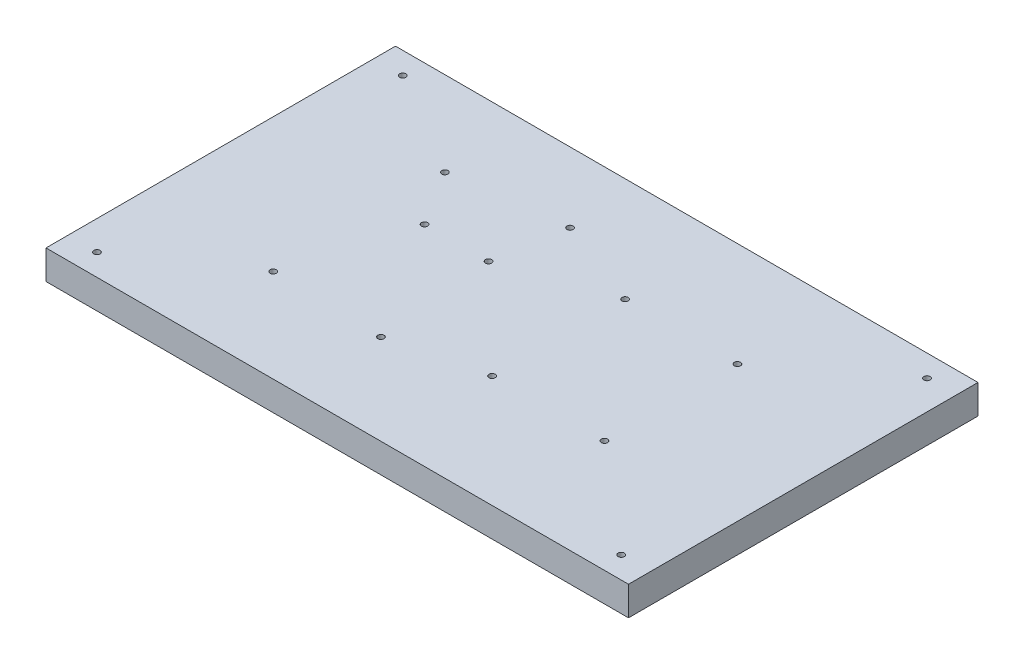
ISO-10303-21;
HEADER;
FILE_DESCRIPTION(('STEP AP214'),'2;1');
FILE_NAME('part.step','',(''),(''),'','','');
FILE_SCHEMA(('AUTOMOTIVE_DESIGN { 1 0 10303 214 1 1 1 1 }'));
ENDSEC;
DATA;
#1=APPLICATION_CONTEXT('core data for automotive mechanical design processes');
#2=APPLICATION_PROTOCOL_DEFINITION('international standard','automotive_design',2000,#1);
#3=PRODUCT_CONTEXT('',#1,'mechanical');
#4=PRODUCT('Part','Part','',(#3));
#5=PRODUCT_RELATED_PRODUCT_CATEGORY('part','',(#4));
#6=PRODUCT_DEFINITION_FORMATION('','',#4);
#7=PRODUCT_DEFINITION_CONTEXT('part definition',#1,'design');
#8=PRODUCT_DEFINITION('design','',#6,#7);
#9=PRODUCT_DEFINITION_SHAPE('','',#8);
#10=(LENGTH_UNIT() NAMED_UNIT(*) SI_UNIT(.MILLI.,.METRE.));
#11=(NAMED_UNIT(*) PLANE_ANGLE_UNIT() SI_UNIT($,.RADIAN.));
#12=(NAMED_UNIT(*) SI_UNIT($,.STERADIAN.) SOLID_ANGLE_UNIT());
#13=UNCERTAINTY_MEASURE_WITH_UNIT(LENGTH_MEASURE(1.E-05),#10,'distance_accuracy_value','');
#14=(GEOMETRIC_REPRESENTATION_CONTEXT(3) GLOBAL_UNCERTAINTY_ASSIGNED_CONTEXT((#13)) GLOBAL_UNIT_ASSIGNED_CONTEXT((#10,
#11,#12)) REPRESENTATION_CONTEXT('',''));
#15=CARTESIAN_POINT('',(0.,0.,0.));
#16=DIRECTION('',(0.,0.,1.));
#17=DIRECTION('',(1.,0.,0.));
#18=AXIS2_PLACEMENT_3D('',#15,#16,#17);
#19=CARTESIAN_POINT('',(0.,12.7,0.));
#20=DIRECTION('',(0.,0.,-1.));
#21=DIRECTION('',(-1.,0.,0.));
#22=AXIS2_PLACEMENT_3D('',#19,#20,#21);
#23=PLANE('',#22);
#24=DIRECTION('',(1.,0.,0.));
#25=VECTOR('',#24,1.);
#26=CARTESIAN_POINT('',(0.,0.,0.));
#27=LINE('',#26,#25);
#28=CARTESIAN_POINT('',(0.,0.,0.));
#29=VERTEX_POINT('',#28);
#30=CARTESIAN_POINT('',(254.,0.,0.));
#31=VERTEX_POINT('',#30);
#32=EDGE_CURVE('E96',#29,#31,#27,.T.);
#33=ORIENTED_EDGE('',*,*,#32,.T.);
#34=DIRECTION('',(0.,-1.,0.));
#35=VECTOR('',#34,1.);
#36=CARTESIAN_POINT('',(254.,12.7,0.));
#37=LINE('',#36,#35);
#38=CARTESIAN_POINT('',(254.,12.7,0.));
#39=VERTEX_POINT('',#38);
#40=EDGE_CURVE('E11',#39,#31,#37,.T.);
#41=ORIENTED_EDGE('',*,*,#40,.F.);
#42=DIRECTION('',(1.,0.,0.));
#43=VECTOR('',#42,1.);
#44=CARTESIAN_POINT('',(0.,12.7,0.));
#45=LINE('',#44,#43);
#46=CARTESIAN_POINT('',(0.,12.7,0.));
#47=VERTEX_POINT('',#46);
#48=EDGE_CURVE('E84',#47,#39,#45,.T.);
#49=ORIENTED_EDGE('',*,*,#48,.F.);
#50=DIRECTION('',(0.,-1.,0.));
#51=VECTOR('',#50,1.);
#52=CARTESIAN_POINT('',(0.,12.7,0.));
#53=LINE('',#52,#51);
#54=EDGE_CURVE('E92',#47,#29,#53,.T.);
#55=ORIENTED_EDGE('',*,*,#54,.T.);
#56=EDGE_LOOP('',(#33,#41,#49,#55));
#57=FACE_BOUND('',#56,.T.);
#58=ADVANCED_FACE('F33',(#57),#23,.F.);
#59=CARTESIAN_POINT('',(254.,12.7,-152.4));
#60=DIRECTION('',(-1.,0.,0.));
#61=DIRECTION('',(0.,0.,1.));
#62=AXIS2_PLACEMENT_3D('',#59,#60,#61);
#63=PLANE('',#62);
#64=DIRECTION('',(0.,0.,-1.));
#65=VECTOR('',#64,1.);
#66=CARTESIAN_POINT('',(254.,0.,-152.4));
#67=LINE('',#66,#65);
#68=CARTESIAN_POINT('',(254.,0.,-152.4));
#69=VERTEX_POINT('',#68);
#70=EDGE_CURVE('E88',#31,#69,#67,.T.);
#71=ORIENTED_EDGE('',*,*,#70,.T.);
#72=DIRECTION('',(0.,-1.,0.));
#73=VECTOR('',#72,1.);
#74=CARTESIAN_POINT('',(254.,12.7,-152.4));
#75=LINE('',#74,#73);
#76=CARTESIAN_POINT('',(254.,12.7,-152.4));
#77=VERTEX_POINT('',#76);
#78=EDGE_CURVE('E41',#77,#69,#75,.T.);
#79=ORIENTED_EDGE('',*,*,#78,.F.);
#80=DIRECTION('',(0.,0.,-1.));
#81=VECTOR('',#80,1.);
#82=CARTESIAN_POINT('',(254.,12.7,-152.4));
#83=LINE('',#82,#81);
#84=EDGE_CURVE('E79',#39,#77,#83,.T.);
#85=ORIENTED_EDGE('',*,*,#84,.F.);
#86=ORIENTED_EDGE('',*,*,#40,.T.);
#87=EDGE_LOOP('',(#71,#79,#85,#86));
#88=FACE_BOUND('',#87,.T.);
#89=ADVANCED_FACE('F87',(#88),#63,.F.);
#90=CARTESIAN_POINT('',(0.,12.7,-152.4));
#91=DIRECTION('',(0.,0.,1.));
#92=DIRECTION('',(1.,0.,0.));
#93=AXIS2_PLACEMENT_3D('',#90,#91,#92);
#94=PLANE('',#93);
#95=DIRECTION('',(-1.,0.,0.));
#96=VECTOR('',#95,1.);
#97=CARTESIAN_POINT('',(0.,0.,-152.4));
#98=LINE('',#97,#96);
#99=CARTESIAN_POINT('',(0.,0.,-152.4));
#100=VERTEX_POINT('',#99);
#101=EDGE_CURVE('E66',#69,#100,#98,.T.);
#102=ORIENTED_EDGE('',*,*,#101,.T.);
#103=DIRECTION('',(0.,-1.,0.));
#104=VECTOR('',#103,1.);
#105=CARTESIAN_POINT('',(0.,12.7,-152.4));
#106=LINE('',#105,#104);
#107=CARTESIAN_POINT('',(0.,12.7,-152.4));
#108=VERTEX_POINT('',#107);
#109=EDGE_CURVE('E89',#108,#100,#106,.T.);
#110=ORIENTED_EDGE('',*,*,#109,.F.);
#111=DIRECTION('',(-1.,0.,0.));
#112=VECTOR('',#111,1.);
#113=CARTESIAN_POINT('',(0.,12.7,-152.4));
#114=LINE('',#113,#112);
#115=EDGE_CURVE('E82',#77,#108,#114,.T.);
#116=ORIENTED_EDGE('',*,*,#115,.F.);
#117=ORIENTED_EDGE('',*,*,#78,.T.);
#118=EDGE_LOOP('',(#102,#110,#116,#117));
#119=FACE_BOUND('',#118,.T.);
#120=ADVANCED_FACE('F90',(#119),#94,.F.);
#121=CARTESIAN_POINT('',(0.,12.7,0.));
#122=DIRECTION('',(1.,0.,0.));
#123=DIRECTION('',(0.,0.,-1.));
#124=AXIS2_PLACEMENT_3D('',#121,#122,#123);
#125=PLANE('',#124);
#126=DIRECTION('',(0.,0.,1.));
#127=VECTOR('',#126,1.);
#128=CARTESIAN_POINT('',(0.,0.,0.));
#129=LINE('',#128,#127);
#130=EDGE_CURVE('E72',#100,#29,#129,.T.);
#131=ORIENTED_EDGE('',*,*,#130,.T.);
#132=ORIENTED_EDGE('',*,*,#54,.F.);
#133=DIRECTION('',(0.,0.,1.));
#134=VECTOR('',#133,1.);
#135=CARTESIAN_POINT('',(0.,12.7,0.));
#136=LINE('',#135,#134);
#137=EDGE_CURVE('E49',#108,#47,#136,.T.);
#138=ORIENTED_EDGE('',*,*,#137,.F.);
#139=ORIENTED_EDGE('',*,*,#109,.T.);
#140=EDGE_LOOP('',(#131,#132,#138,#139));
#141=FACE_BOUND('',#140,.T.);
#142=ADVANCED_FACE('F104',(#141),#125,.F.);
#143=CARTESIAN_POINT('',(0.,12.7,0.));
#144=DIRECTION('',(0.,-1.,0.));
#145=DIRECTION('',(0.,0.,-1.));
#146=AXIS2_PLACEMENT_3D('',#143,#144,#145);
#147=PLANE('',#146);
#148=CARTESIAN_POINT('',(12.7,12.7,-9.52500000000001));
#149=DIRECTION('',(0.,1.,0.));
#150=DIRECTION('',(0.,0.,1.));
#151=AXIS2_PLACEMENT_3D('',#148,#149,#150);
#152=CIRCLE('',#151,1.34999999999999);
#153=CARTESIAN_POINT('',(12.7,12.7,-8.17500000000001));
#154=VERTEX_POINT('',#153);
#155=EDGE_CURVE('E190',#154,#154,#152,.T.);
#156=ORIENTED_EDGE('',*,*,#155,.F.);
#157=EDGE_LOOP('',(#156));
#158=FACE_BOUND('',#157,.T.);
#159=CARTESIAN_POINT('',(241.3,12.7,-9.52500000000001));
#160=DIRECTION('',(0.,1.,0.));
#161=DIRECTION('',(0.,0.,1.));
#162=AXIS2_PLACEMENT_3D('',#159,#160,#161);
#163=CIRCLE('',#162,1.34999999999999);
#164=CARTESIAN_POINT('',(241.3,12.7,-8.17500000000001));
#165=VERTEX_POINT('',#164);
#166=EDGE_CURVE('E184',#165,#165,#163,.T.);
#167=ORIENTED_EDGE('',*,*,#166,.F.);
#168=EDGE_LOOP('',(#167));
#169=FACE_BOUND('',#168,.T.);
#170=CARTESIAN_POINT('',(241.3,12.7,-142.875));
#171=DIRECTION('',(0.,1.,0.));
#172=DIRECTION('',(0.,0.,1.));
#173=AXIS2_PLACEMENT_3D('',#170,#171,#172);
#174=CIRCLE('',#173,1.34999999999999);
#175=CARTESIAN_POINT('',(241.3,12.7,-141.525));
#176=VERTEX_POINT('',#175);
#177=EDGE_CURVE('E178',#176,#176,#174,.T.);
#178=ORIENTED_EDGE('',*,*,#177,.F.);
#179=EDGE_LOOP('',(#178));
#180=FACE_BOUND('',#179,.T.);
#181=CARTESIAN_POINT('',(12.7,12.7,-142.875));
#182=DIRECTION('',(0.,1.,0.));
#183=DIRECTION('',(0.,0.,1.));
#184=AXIS2_PLACEMENT_3D('',#181,#182,#183);
#185=CIRCLE('',#184,1.34999999999999);
#186=CARTESIAN_POINT('',(12.7,12.7,-141.525));
#187=VERTEX_POINT('',#186);
#188=EDGE_CURVE('E172',#187,#187,#185,.T.);
#189=ORIENTED_EDGE('',*,*,#188,.F.);
#190=EDGE_LOOP('',(#189));
#191=FACE_BOUND('',#190,.T.);
#192=CARTESIAN_POINT('',(194.619999888,12.7,-48.9));
#193=DIRECTION('',(0.,1.,0.));
#194=DIRECTION('',(0.,0.,1.));
#195=AXIS2_PLACEMENT_3D('',#192,#193,#194);
#196=CIRCLE('',#195,1.34999999999999);
#197=CARTESIAN_POINT('',(194.619999888,12.7,-47.55));
#198=VERTEX_POINT('',#197);
#199=EDGE_CURVE('E166',#198,#198,#196,.T.);
#200=ORIENTED_EDGE('',*,*,#199,.F.);
#201=EDGE_LOOP('',(#200));
#202=FACE_BOUND('',#201,.T.);
#203=CARTESIAN_POINT('',(194.619999888,12.7,-106.9));
#204=DIRECTION('',(0.,1.,0.));
#205=DIRECTION('',(0.,0.,1.));
#206=AXIS2_PLACEMENT_3D('',#203,#204,#205);
#207=CIRCLE('',#206,1.34999999999999);
#208=CARTESIAN_POINT('',(194.619999888,12.7,-105.55));
#209=VERTEX_POINT('',#208);
#210=EDGE_CURVE('E160',#209,#209,#207,.T.);
#211=ORIENTED_EDGE('',*,*,#210,.F.);
#212=EDGE_LOOP('',(#211));
#213=FACE_BOUND('',#212,.T.);
#214=CARTESIAN_POINT('',(145.619999888,12.7,-106.9));
#215=DIRECTION('',(0.,1.,0.));
#216=DIRECTION('',(0.,0.,1.));
#217=AXIS2_PLACEMENT_3D('',#214,#215,#216);
#218=CIRCLE('',#217,1.34999999999999);
#219=CARTESIAN_POINT('',(145.619999888,12.7,-105.55));
#220=VERTEX_POINT('',#219);
#221=EDGE_CURVE('E154',#220,#220,#218,.T.);
#222=ORIENTED_EDGE('',*,*,#221,.F.);
#223=EDGE_LOOP('',(#222));
#224=FACE_BOUND('',#223,.T.);
#225=CARTESIAN_POINT('',(145.619999888,12.7,-48.9));
#226=DIRECTION('',(0.,1.,0.));
#227=DIRECTION('',(0.,0.,1.));
#228=AXIS2_PLACEMENT_3D('',#225,#226,#227);
#229=CIRCLE('',#228,1.34999999999999);
#230=CARTESIAN_POINT('',(145.619999888,12.7,-47.55));
#231=VERTEX_POINT('',#230);
#232=EDGE_CURVE('E148',#231,#231,#229,.T.);
#233=ORIENTED_EDGE('',*,*,#232,.F.);
#234=EDGE_LOOP('',(#233));
#235=FACE_BOUND('',#234,.T.);
#236=CARTESIAN_POINT('',(106.64,12.7,-121.87));
#237=DIRECTION('',(0.,1.,0.));
#238=DIRECTION('',(0.,0.,1.));
#239=AXIS2_PLACEMENT_3D('',#236,#237,#238);
#240=CIRCLE('',#239,1.35);
#241=CARTESIAN_POINT('',(106.64,12.7,-120.52));
#242=VERTEX_POINT('',#241);
#243=EDGE_CURVE('E142',#242,#242,#240,.T.);
#244=ORIENTED_EDGE('',*,*,#243,.F.);
#245=EDGE_LOOP('',(#244));
#246=FACE_BOUND('',#245,.T.);
#247=CARTESIAN_POINT('',(58.42,12.7,-115.51));
#248=DIRECTION('',(0.,1.,0.));
#249=DIRECTION('',(0.,0.,1.));
#250=AXIS2_PLACEMENT_3D('',#247,#248,#249);
#251=CIRCLE('',#250,1.35);
#252=CARTESIAN_POINT('',(58.42,12.7,-114.16));
#253=VERTEX_POINT('',#252);
#254=EDGE_CURVE('E136',#253,#253,#251,.T.);
#255=ORIENTED_EDGE('',*,*,#254,.F.);
#256=EDGE_LOOP('',(#255));
#257=FACE_BOUND('',#256,.T.);
#258=CARTESIAN_POINT('',(101.56,12.7,-91.42));
#259=DIRECTION('',(0.,1.,0.));
#260=DIRECTION('',(0.,0.,1.));
#261=AXIS2_PLACEMENT_3D('',#258,#259,#260);
#262=CIRCLE('',#261,1.35);
#263=CARTESIAN_POINT('',(101.56,12.7,-90.07));
#264=VERTEX_POINT('',#263);
#265=EDGE_CURVE('E130',#264,#264,#262,.T.);
#266=ORIENTED_EDGE('',*,*,#265,.F.);
#267=EDGE_LOOP('',(#266));
#268=FACE_BOUND('',#267,.T.);
#269=CARTESIAN_POINT('',(73.65,12.7,-91.42));
#270=DIRECTION('',(0.,1.,0.));
#271=DIRECTION('',(0.,0.,1.));
#272=AXIS2_PLACEMENT_3D('',#269,#270,#271);
#273=CIRCLE('',#272,1.35);
#274=CARTESIAN_POINT('',(73.65,12.7,-90.07));
#275=VERTEX_POINT('',#274);
#276=EDGE_CURVE('E124',#275,#275,#273,.T.);
#277=ORIENTED_EDGE('',*,*,#276,.F.);
#278=EDGE_LOOP('',(#277));
#279=FACE_BOUND('',#278,.T.);
#280=CARTESIAN_POINT('',(58.42,12.7,-40.63));
#281=DIRECTION('',(0.,1.,0.));
#282=DIRECTION('',(0.,0.,1.));
#283=AXIS2_PLACEMENT_3D('',#280,#281,#282);
#284=CIRCLE('',#283,1.35);
#285=CARTESIAN_POINT('',(58.42,12.7,-39.28));
#286=VERTEX_POINT('',#285);
#287=EDGE_CURVE('E118',#286,#286,#284,.T.);
#288=ORIENTED_EDGE('',*,*,#287,.F.);
#289=EDGE_LOOP('',(#288));
#290=FACE_BOUND('',#289,.T.);
#291=CARTESIAN_POINT('',(106.64,12.7,-39.4));
#292=DIRECTION('',(0.,1.,0.));
#293=DIRECTION('',(0.,0.,1.));
#294=AXIS2_PLACEMENT_3D('',#291,#292,#293);
#295=CIRCLE('',#294,1.35);
#296=CARTESIAN_POINT('',(106.64,12.7,-38.05));
#297=VERTEX_POINT('',#296);
#298=EDGE_CURVE('E112',#297,#297,#295,.T.);
#299=ORIENTED_EDGE('',*,*,#298,.F.);
#300=EDGE_LOOP('',(#299));
#301=FACE_BOUND('',#300,.T.);
#302=ORIENTED_EDGE('',*,*,#48,.T.);
#303=ORIENTED_EDGE('',*,*,#84,.T.);
#304=ORIENTED_EDGE('',*,*,#115,.T.);
#305=ORIENTED_EDGE('',*,*,#137,.T.);
#306=EDGE_LOOP('',(#302,#303,#304,#305));
#307=FACE_BOUND('',#306,.T.);
#308=ADVANCED_FACE('F80',(#158,#169,#180,#191,#202,#213,#224,#235,#246,#257,#268,#279,#290,#301,
#307),#147,.F.);
#309=CARTESIAN_POINT('',(0.,0.,0.));
#310=DIRECTION('',(0.,-1.,0.));
#311=DIRECTION('',(0.,0.,-1.));
#312=AXIS2_PLACEMENT_3D('',#309,#310,#311);
#313=PLANE('',#312);
#314=CARTESIAN_POINT('',(12.7,0.,-9.52500000000001));
#315=DIRECTION('',(0.,-1.,0.));
#316=DIRECTION('',(0.,0.,-1.));
#317=AXIS2_PLACEMENT_3D('',#314,#315,#316);
#318=CIRCLE('',#317,1.34999999999999);
#319=CARTESIAN_POINT('',(12.7,0.,-10.875));
#320=VERTEX_POINT('',#319);
#321=EDGE_CURVE('E187',#320,#320,#318,.T.);
#322=ORIENTED_EDGE('',*,*,#321,.F.);
#323=EDGE_LOOP('',(#322));
#324=FACE_BOUND('',#323,.T.);
#325=CARTESIAN_POINT('',(241.3,0.,-9.52500000000001));
#326=DIRECTION('',(0.,-1.,0.));
#327=DIRECTION('',(0.,0.,-1.));
#328=AXIS2_PLACEMENT_3D('',#325,#326,#327);
#329=CIRCLE('',#328,1.34999999999999);
#330=CARTESIAN_POINT('',(241.3,0.,-10.875));
#331=VERTEX_POINT('',#330);
#332=EDGE_CURVE('E181',#331,#331,#329,.T.);
#333=ORIENTED_EDGE('',*,*,#332,.F.);
#334=EDGE_LOOP('',(#333));
#335=FACE_BOUND('',#334,.T.);
#336=CARTESIAN_POINT('',(241.3,0.,-142.875));
#337=DIRECTION('',(0.,-1.,0.));
#338=DIRECTION('',(0.,0.,-1.));
#339=AXIS2_PLACEMENT_3D('',#336,#337,#338);
#340=CIRCLE('',#339,1.34999999999999);
#341=CARTESIAN_POINT('',(241.3,0.,-144.225));
#342=VERTEX_POINT('',#341);
#343=EDGE_CURVE('E175',#342,#342,#340,.T.);
#344=ORIENTED_EDGE('',*,*,#343,.F.);
#345=EDGE_LOOP('',(#344));
#346=FACE_BOUND('',#345,.T.);
#347=CARTESIAN_POINT('',(12.7,0.,-142.875));
#348=DIRECTION('',(0.,-1.,0.));
#349=DIRECTION('',(0.,0.,-1.));
#350=AXIS2_PLACEMENT_3D('',#347,#348,#349);
#351=CIRCLE('',#350,1.34999999999999);
#352=CARTESIAN_POINT('',(12.7,0.,-144.225));
#353=VERTEX_POINT('',#352);
#354=EDGE_CURVE('E169',#353,#353,#351,.T.);
#355=ORIENTED_EDGE('',*,*,#354,.F.);
#356=EDGE_LOOP('',(#355));
#357=FACE_BOUND('',#356,.T.);
#358=ORIENTED_EDGE('',*,*,#32,.F.);
#359=ORIENTED_EDGE('',*,*,#130,.F.);
#360=ORIENTED_EDGE('',*,*,#101,.F.);
#361=ORIENTED_EDGE('',*,*,#70,.F.);
#362=EDGE_LOOP('',(#358,#359,#360,#361));
#363=FACE_BOUND('',#362,.T.);
#364=ADVANCED_FACE('F107',(#324,#335,#346,#357,#363),#313,.T.);
#365=CARTESIAN_POINT('',(106.64,3.81,-39.4));
#366=DIRECTION('',(0.,-1.,0.));
#367=DIRECTION('',(0.,0.,-1.));
#368=AXIS2_PLACEMENT_3D('',#365,#366,#367);
#369=PLANE('',#368);
#370=CARTESIAN_POINT('',(106.64,3.81,-39.4));
#371=DIRECTION('',(0.,1.,0.));
#372=DIRECTION('',(0.,0.,1.));
#373=AXIS2_PLACEMENT_3D('',#370,#371,#372);
#374=CIRCLE('',#373,1.35);
#375=CARTESIAN_POINT('',(106.64,3.81,-38.05));
#376=VERTEX_POINT('',#375);
#377=EDGE_CURVE('E99',#376,#376,#374,.T.);
#378=ORIENTED_EDGE('',*,*,#377,.T.);
#379=EDGE_LOOP('',(#378));
#380=FACE_BOUND('',#379,.T.);
#381=ADVANCED_FACE('F228',(#380),#369,.F.);
#382=CARTESIAN_POINT('',(106.64,12.7,-39.4));
#383=DIRECTION('',(0.,1.,0.));
#384=DIRECTION('',(0.,0.,1.));
#385=AXIS2_PLACEMENT_3D('',#382,#383,#384);
#386=CYLINDRICAL_SURFACE('',#385,1.35);
#387=ORIENTED_EDGE('',*,*,#377,.F.);
#388=EDGE_LOOP('',(#387));
#389=FACE_BOUND('',#388,.T.);
#390=ORIENTED_EDGE('',*,*,#298,.T.);
#391=EDGE_LOOP('',(#390));
#392=FACE_BOUND('',#391,.T.);
#393=ADVANCED_FACE('F225',(#389,#392),#386,.F.);
#394=CARTESIAN_POINT('',(58.42,3.81,-40.63));
#395=DIRECTION('',(0.,-1.,0.));
#396=DIRECTION('',(0.,0.,-1.));
#397=AXIS2_PLACEMENT_3D('',#394,#395,#396);
#398=PLANE('',#397);
#399=CARTESIAN_POINT('',(58.42,3.81,-40.63));
#400=DIRECTION('',(0.,1.,0.));
#401=DIRECTION('',(0.,0.,1.));
#402=AXIS2_PLACEMENT_3D('',#399,#400,#401);
#403=CIRCLE('',#402,1.35);
#404=CARTESIAN_POINT('',(58.42,3.81,-39.28));
#405=VERTEX_POINT('',#404);
#406=EDGE_CURVE('E115',#405,#405,#403,.T.);
#407=ORIENTED_EDGE('',*,*,#406,.T.);
#408=EDGE_LOOP('',(#407));
#409=FACE_BOUND('',#408,.T.);
#410=ADVANCED_FACE('F227',(#409),#398,.F.);
#411=CARTESIAN_POINT('',(58.42,12.7,-40.63));
#412=DIRECTION('',(0.,1.,0.));
#413=DIRECTION('',(0.,0.,1.));
#414=AXIS2_PLACEMENT_3D('',#411,#412,#413);
#415=CYLINDRICAL_SURFACE('',#414,1.35);
#416=ORIENTED_EDGE('',*,*,#406,.F.);
#417=EDGE_LOOP('',(#416));
#418=FACE_BOUND('',#417,.T.);
#419=ORIENTED_EDGE('',*,*,#287,.T.);
#420=EDGE_LOOP('',(#419));
#421=FACE_BOUND('',#420,.T.);
#422=ADVANCED_FACE('F235',(#418,#421),#415,.F.);
#423=CARTESIAN_POINT('',(73.65,3.81,-91.42));
#424=DIRECTION('',(0.,-1.,0.));
#425=DIRECTION('',(0.,0.,-1.));
#426=AXIS2_PLACEMENT_3D('',#423,#424,#425);
#427=PLANE('',#426);
#428=CARTESIAN_POINT('',(73.65,3.81,-91.42));
#429=DIRECTION('',(0.,1.,0.));
#430=DIRECTION('',(0.,0.,1.));
#431=AXIS2_PLACEMENT_3D('',#428,#429,#430);
#432=CIRCLE('',#431,1.35);
#433=CARTESIAN_POINT('',(73.65,3.81,-90.07));
#434=VERTEX_POINT('',#433);
#435=EDGE_CURVE('E121',#434,#434,#432,.T.);
#436=ORIENTED_EDGE('',*,*,#435,.T.);
#437=EDGE_LOOP('',(#436));
#438=FACE_BOUND('',#437,.T.);
#439=ADVANCED_FACE('F336',(#438),#427,.F.);
#440=CARTESIAN_POINT('',(73.65,12.7,-91.42));
#441=DIRECTION('',(0.,1.,0.));
#442=DIRECTION('',(0.,0.,1.));
#443=AXIS2_PLACEMENT_3D('',#440,#441,#442);
#444=CYLINDRICAL_SURFACE('',#443,1.35);
#445=ORIENTED_EDGE('',*,*,#435,.F.);
#446=EDGE_LOOP('',(#445));
#447=FACE_BOUND('',#446,.T.);
#448=ORIENTED_EDGE('',*,*,#276,.T.);
#449=EDGE_LOOP('',(#448));
#450=FACE_BOUND('',#449,.T.);
#451=ADVANCED_FACE('F332',(#447,#450),#444,.F.);
#452=CARTESIAN_POINT('',(101.56,3.81,-91.42));
#453=DIRECTION('',(0.,-1.,0.));
#454=DIRECTION('',(0.,0.,-1.));
#455=AXIS2_PLACEMENT_3D('',#452,#453,#454);
#456=PLANE('',#455);
#457=CARTESIAN_POINT('',(101.56,3.81,-91.42));
#458=DIRECTION('',(0.,1.,0.));
#459=DIRECTION('',(0.,0.,1.));
#460=AXIS2_PLACEMENT_3D('',#457,#458,#459);
#461=CIRCLE('',#460,1.35);
#462=CARTESIAN_POINT('',(101.56,3.81,-90.07));
#463=VERTEX_POINT('',#462);
#464=EDGE_CURVE('E127',#463,#463,#461,.T.);
#465=ORIENTED_EDGE('',*,*,#464,.T.);
#466=EDGE_LOOP('',(#465));
#467=FACE_BOUND('',#466,.T.);
#468=ADVANCED_FACE('F328',(#467),#456,.F.);
#469=CARTESIAN_POINT('',(101.56,12.7,-91.42));
#470=DIRECTION('',(0.,1.,0.));
#471=DIRECTION('',(0.,0.,1.));
#472=AXIS2_PLACEMENT_3D('',#469,#470,#471);
#473=CYLINDRICAL_SURFACE('',#472,1.35);
#474=ORIENTED_EDGE('',*,*,#464,.F.);
#475=EDGE_LOOP('',(#474));
#476=FACE_BOUND('',#475,.T.);
#477=ORIENTED_EDGE('',*,*,#265,.T.);
#478=EDGE_LOOP('',(#477));
#479=FACE_BOUND('',#478,.T.);
#480=ADVANCED_FACE('F324',(#476,#479),#473,.F.);
#481=CARTESIAN_POINT('',(58.42,3.81,-115.51));
#482=DIRECTION('',(0.,-1.,0.));
#483=DIRECTION('',(0.,0.,-1.));
#484=AXIS2_PLACEMENT_3D('',#481,#482,#483);
#485=PLANE('',#484);
#486=CARTESIAN_POINT('',(58.42,3.81,-115.51));
#487=DIRECTION('',(0.,1.,0.));
#488=DIRECTION('',(0.,0.,1.));
#489=AXIS2_PLACEMENT_3D('',#486,#487,#488);
#490=CIRCLE('',#489,1.35);
#491=CARTESIAN_POINT('',(58.42,3.81,-114.16));
#492=VERTEX_POINT('',#491);
#493=EDGE_CURVE('E133',#492,#492,#490,.T.);
#494=ORIENTED_EDGE('',*,*,#493,.T.);
#495=EDGE_LOOP('',(#494));
#496=FACE_BOUND('',#495,.T.);
#497=ADVANCED_FACE('F320',(#496),#485,.F.);
#498=CARTESIAN_POINT('',(58.42,12.7,-115.51));
#499=DIRECTION('',(0.,1.,0.));
#500=DIRECTION('',(0.,0.,1.));
#501=AXIS2_PLACEMENT_3D('',#498,#499,#500);
#502=CYLINDRICAL_SURFACE('',#501,1.35);
#503=ORIENTED_EDGE('',*,*,#493,.F.);
#504=EDGE_LOOP('',(#503));
#505=FACE_BOUND('',#504,.T.);
#506=ORIENTED_EDGE('',*,*,#254,.T.);
#507=EDGE_LOOP('',(#506));
#508=FACE_BOUND('',#507,.T.);
#509=ADVANCED_FACE('F316',(#505,#508),#502,.F.);
#510=CARTESIAN_POINT('',(106.64,3.81,-121.87));
#511=DIRECTION('',(0.,-1.,0.));
#512=DIRECTION('',(0.,0.,-1.));
#513=AXIS2_PLACEMENT_3D('',#510,#511,#512);
#514=PLANE('',#513);
#515=CARTESIAN_POINT('',(106.64,3.81,-121.87));
#516=DIRECTION('',(0.,1.,0.));
#517=DIRECTION('',(0.,0.,1.));
#518=AXIS2_PLACEMENT_3D('',#515,#516,#517);
#519=CIRCLE('',#518,1.35);
#520=CARTESIAN_POINT('',(106.64,3.81,-120.52));
#521=VERTEX_POINT('',#520);
#522=EDGE_CURVE('E139',#521,#521,#519,.T.);
#523=ORIENTED_EDGE('',*,*,#522,.T.);
#524=EDGE_LOOP('',(#523));
#525=FACE_BOUND('',#524,.T.);
#526=ADVANCED_FACE('F312',(#525),#514,.F.);
#527=CARTESIAN_POINT('',(106.64,12.7,-121.87));
#528=DIRECTION('',(0.,1.,0.));
#529=DIRECTION('',(0.,0.,1.));
#530=AXIS2_PLACEMENT_3D('',#527,#528,#529);
#531=CYLINDRICAL_SURFACE('',#530,1.35);
#532=ORIENTED_EDGE('',*,*,#522,.F.);
#533=EDGE_LOOP('',(#532));
#534=FACE_BOUND('',#533,.T.);
#535=ORIENTED_EDGE('',*,*,#243,.T.);
#536=EDGE_LOOP('',(#535));
#537=FACE_BOUND('',#536,.T.);
#538=ADVANCED_FACE('F308',(#534,#537),#531,.F.);
#539=CARTESIAN_POINT('',(145.619999888,3.81,-48.9));
#540=DIRECTION('',(0.,-1.,0.));
#541=DIRECTION('',(0.,0.,-1.));
#542=AXIS2_PLACEMENT_3D('',#539,#540,#541);
#543=PLANE('',#542);
#544=CARTESIAN_POINT('',(145.619999888,3.81,-48.9));
#545=DIRECTION('',(0.,1.,0.));
#546=DIRECTION('',(0.,0.,1.));
#547=AXIS2_PLACEMENT_3D('',#544,#545,#546);
#548=CIRCLE('',#547,1.34999999999999);
#549=CARTESIAN_POINT('',(145.619999888,3.81,-47.55));
#550=VERTEX_POINT('',#549);
#551=EDGE_CURVE('E145',#550,#550,#548,.T.);
#552=ORIENTED_EDGE('',*,*,#551,.T.);
#553=EDGE_LOOP('',(#552));
#554=FACE_BOUND('',#553,.T.);
#555=ADVANCED_FACE('F304',(#554),#543,.F.);
#556=CARTESIAN_POINT('',(145.619999888,12.7,-48.9));
#557=DIRECTION('',(0.,1.,0.));
#558=DIRECTION('',(0.,0.,1.));
#559=AXIS2_PLACEMENT_3D('',#556,#557,#558);
#560=CYLINDRICAL_SURFACE('',#559,1.34999999999999);
#561=ORIENTED_EDGE('',*,*,#551,.F.);
#562=EDGE_LOOP('',(#561));
#563=FACE_BOUND('',#562,.T.);
#564=ORIENTED_EDGE('',*,*,#232,.T.);
#565=EDGE_LOOP('',(#564));
#566=FACE_BOUND('',#565,.T.);
#567=ADVANCED_FACE('F300',(#563,#566),#560,.F.);
#568=CARTESIAN_POINT('',(145.619999888,3.81,-106.9));
#569=DIRECTION('',(0.,-1.,0.));
#570=DIRECTION('',(0.,0.,-1.));
#571=AXIS2_PLACEMENT_3D('',#568,#569,#570);
#572=PLANE('',#571);
#573=CARTESIAN_POINT('',(145.619999888,3.81,-106.9));
#574=DIRECTION('',(0.,1.,0.));
#575=DIRECTION('',(0.,0.,1.));
#576=AXIS2_PLACEMENT_3D('',#573,#574,#575);
#577=CIRCLE('',#576,1.34999999999999);
#578=CARTESIAN_POINT('',(145.619999888,3.81,-105.55));
#579=VERTEX_POINT('',#578);
#580=EDGE_CURVE('E151',#579,#579,#577,.T.);
#581=ORIENTED_EDGE('',*,*,#580,.T.);
#582=EDGE_LOOP('',(#581));
#583=FACE_BOUND('',#582,.T.);
#584=ADVANCED_FACE('F296',(#583),#572,.F.);
#585=CARTESIAN_POINT('',(145.619999888,12.7,-106.9));
#586=DIRECTION('',(0.,1.,0.));
#587=DIRECTION('',(0.,0.,1.));
#588=AXIS2_PLACEMENT_3D('',#585,#586,#587);
#589=CYLINDRICAL_SURFACE('',#588,1.34999999999999);
#590=ORIENTED_EDGE('',*,*,#580,.F.);
#591=EDGE_LOOP('',(#590));
#592=FACE_BOUND('',#591,.T.);
#593=ORIENTED_EDGE('',*,*,#221,.T.);
#594=EDGE_LOOP('',(#593));
#595=FACE_BOUND('',#594,.T.);
#596=ADVANCED_FACE('F292',(#592,#595),#589,.F.);
#597=CARTESIAN_POINT('',(194.619999888,3.81,-106.9));
#598=DIRECTION('',(0.,-1.,0.));
#599=DIRECTION('',(0.,0.,-1.));
#600=AXIS2_PLACEMENT_3D('',#597,#598,#599);
#601=PLANE('',#600);
#602=CARTESIAN_POINT('',(194.619999888,3.81,-106.9));
#603=DIRECTION('',(0.,1.,0.));
#604=DIRECTION('',(0.,0.,1.));
#605=AXIS2_PLACEMENT_3D('',#602,#603,#604);
#606=CIRCLE('',#605,1.34999999999999);
#607=CARTESIAN_POINT('',(194.619999888,3.81,-105.55));
#608=VERTEX_POINT('',#607);
#609=EDGE_CURVE('E157',#608,#608,#606,.T.);
#610=ORIENTED_EDGE('',*,*,#609,.T.);
#611=EDGE_LOOP('',(#610));
#612=FACE_BOUND('',#611,.T.);
#613=ADVANCED_FACE('F288',(#612),#601,.F.);
#614=CARTESIAN_POINT('',(194.619999888,12.7,-106.9));
#615=DIRECTION('',(0.,1.,0.));
#616=DIRECTION('',(0.,0.,1.));
#617=AXIS2_PLACEMENT_3D('',#614,#615,#616);
#618=CYLINDRICAL_SURFACE('',#617,1.34999999999999);
#619=ORIENTED_EDGE('',*,*,#609,.F.);
#620=EDGE_LOOP('',(#619));
#621=FACE_BOUND('',#620,.T.);
#622=ORIENTED_EDGE('',*,*,#210,.T.);
#623=EDGE_LOOP('',(#622));
#624=FACE_BOUND('',#623,.T.);
#625=ADVANCED_FACE('F284',(#621,#624),#618,.F.);
#626=CARTESIAN_POINT('',(194.619999888,3.81,-48.9));
#627=DIRECTION('',(0.,-1.,0.));
#628=DIRECTION('',(0.,0.,-1.));
#629=AXIS2_PLACEMENT_3D('',#626,#627,#628);
#630=PLANE('',#629);
#631=CARTESIAN_POINT('',(194.619999888,3.81,-48.9));
#632=DIRECTION('',(0.,1.,0.));
#633=DIRECTION('',(0.,0.,1.));
#634=AXIS2_PLACEMENT_3D('',#631,#632,#633);
#635=CIRCLE('',#634,1.34999999999999);
#636=CARTESIAN_POINT('',(194.619999888,3.81,-47.55));
#637=VERTEX_POINT('',#636);
#638=EDGE_CURVE('E163',#637,#637,#635,.T.);
#639=ORIENTED_EDGE('',*,*,#638,.T.);
#640=EDGE_LOOP('',(#639));
#641=FACE_BOUND('',#640,.T.);
#642=ADVANCED_FACE('F277',(#641),#630,.F.);
#643=CARTESIAN_POINT('',(194.619999888,12.7,-48.9));
#644=DIRECTION('',(0.,1.,0.));
#645=DIRECTION('',(0.,0.,1.));
#646=AXIS2_PLACEMENT_3D('',#643,#644,#645);
#647=CYLINDRICAL_SURFACE('',#646,1.34999999999999);
#648=ORIENTED_EDGE('',*,*,#638,.F.);
#649=EDGE_LOOP('',(#648));
#650=FACE_BOUND('',#649,.T.);
#651=ORIENTED_EDGE('',*,*,#199,.T.);
#652=EDGE_LOOP('',(#651));
#653=FACE_BOUND('',#652,.T.);
#654=ADVANCED_FACE('F269',(#650,#653),#647,.F.);
#655=CARTESIAN_POINT('',(12.7,12.7,-142.875));
#656=DIRECTION('',(0.,1.,0.));
#657=DIRECTION('',(0.,0.,1.));
#658=AXIS2_PLACEMENT_3D('',#655,#656,#657);
#659=CYLINDRICAL_SURFACE('',#658,1.34999999999999);
#660=ORIENTED_EDGE('',*,*,#354,.T.);
#661=EDGE_LOOP('',(#660));
#662=FACE_BOUND('',#661,.T.);
#663=ORIENTED_EDGE('',*,*,#188,.T.);
#664=EDGE_LOOP('',(#663));
#665=FACE_BOUND('',#664,.T.);
#666=ADVANCED_FACE('F265',(#662,#665),#659,.F.);
#667=CARTESIAN_POINT('',(241.3,12.7,-142.875));
#668=DIRECTION('',(0.,1.,0.));
#669=DIRECTION('',(0.,0.,1.));
#670=AXIS2_PLACEMENT_3D('',#667,#668,#669);
#671=CYLINDRICAL_SURFACE('',#670,1.34999999999999);
#672=ORIENTED_EDGE('',*,*,#343,.T.);
#673=EDGE_LOOP('',(#672));
#674=FACE_BOUND('',#673,.T.);
#675=ORIENTED_EDGE('',*,*,#177,.T.);
#676=EDGE_LOOP('',(#675));
#677=FACE_BOUND('',#676,.T.);
#678=ADVANCED_FACE('F268',(#674,#677),#671,.F.);
#679=CARTESIAN_POINT('',(241.3,12.7,-9.52500000000001));
#680=DIRECTION('',(0.,1.,0.));
#681=DIRECTION('',(0.,0.,1.));
#682=AXIS2_PLACEMENT_3D('',#679,#680,#681);
#683=CYLINDRICAL_SURFACE('',#682,1.34999999999999);
#684=ORIENTED_EDGE('',*,*,#332,.T.);
#685=EDGE_LOOP('',(#684));
#686=FACE_BOUND('',#685,.T.);
#687=ORIENTED_EDGE('',*,*,#166,.T.);
#688=EDGE_LOOP('',(#687));
#689=FACE_BOUND('',#688,.T.);
#690=ADVANCED_FACE('F274',(#686,#689),#683,.F.);
#691=CARTESIAN_POINT('',(12.7,12.7,-9.52500000000001));
#692=DIRECTION('',(0.,1.,0.));
#693=DIRECTION('',(0.,0.,1.));
#694=AXIS2_PLACEMENT_3D('',#691,#692,#693);
#695=CYLINDRICAL_SURFACE('',#694,1.34999999999999);
#696=ORIENTED_EDGE('',*,*,#321,.T.);
#697=EDGE_LOOP('',(#696));
#698=FACE_BOUND('',#697,.T.);
#699=ORIENTED_EDGE('',*,*,#155,.T.);
#700=EDGE_LOOP('',(#699));
#701=FACE_BOUND('',#700,.T.);
#702=ADVANCED_FACE('F194',(#698,#701),#695,.F.);
#703=CLOSED_SHELL('',(#58,#89,#120,#142,#308,#364,#381,#393,#410,#422,#439,#451,#468,#480,#497,
#509,#526,#538,#555,#567,#584,#596,#613,#625,#642,#654,#666,#678,#690,#702));
#704=MANIFOLD_SOLID_BREP('B2',#703);
#705=ADVANCED_BREP_SHAPE_REPRESENTATION('',(#18,#704),#14);
#706=SHAPE_DEFINITION_REPRESENTATION(#9,#705);
ENDSEC;
END-ISO-10303-21;
